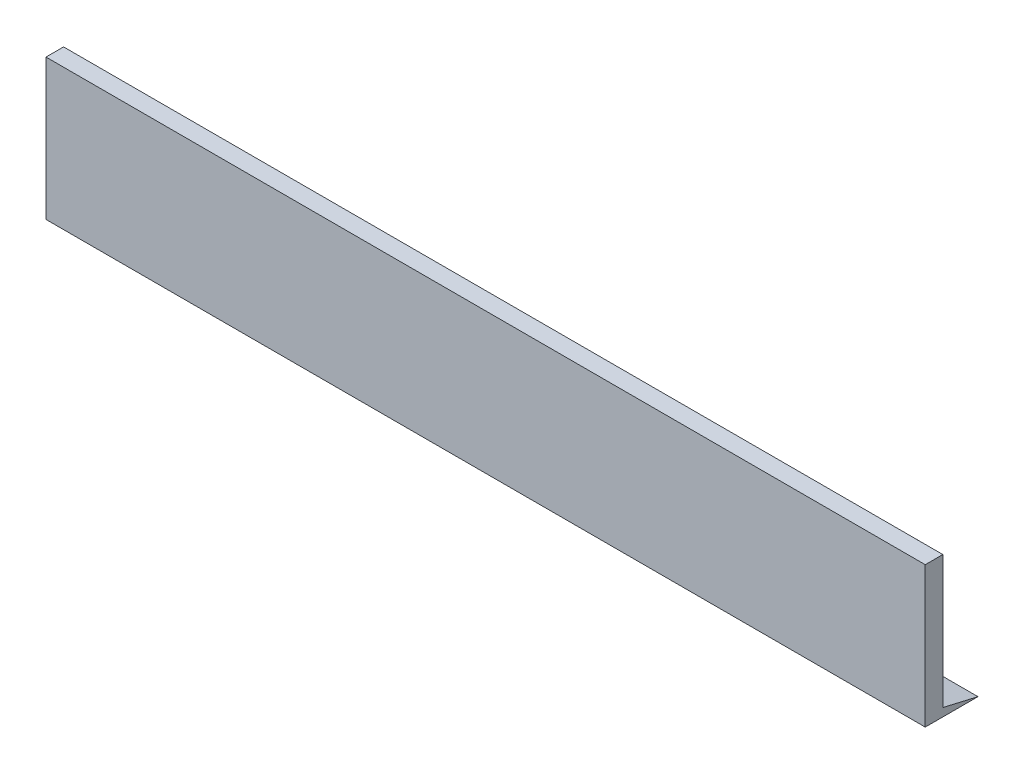
ISO-10303-21;
HEADER;
FILE_DESCRIPTION(('STEP AP214'),'2;1');
FILE_NAME('part.step','',(''),(''),'','','');
FILE_SCHEMA(('AUTOMOTIVE_DESIGN { 1 0 10303 214 1 1 1 1 }'));
ENDSEC;
DATA;
#1=APPLICATION_CONTEXT('core data for automotive mechanical design processes');
#2=APPLICATION_PROTOCOL_DEFINITION('international standard','automotive_design',2000,#1);
#3=PRODUCT_CONTEXT('',#1,'mechanical');
#4=PRODUCT('Part','Part','',(#3));
#5=PRODUCT_RELATED_PRODUCT_CATEGORY('part','',(#4));
#6=PRODUCT_DEFINITION_FORMATION('','',#4);
#7=PRODUCT_DEFINITION_CONTEXT('part definition',#1,'design');
#8=PRODUCT_DEFINITION('design','',#6,#7);
#9=PRODUCT_DEFINITION_SHAPE('','',#8);
#10=(LENGTH_UNIT() NAMED_UNIT(*) SI_UNIT(.MILLI.,.METRE.));
#11=(NAMED_UNIT(*) PLANE_ANGLE_UNIT() SI_UNIT($,.RADIAN.));
#12=(NAMED_UNIT(*) SI_UNIT($,.STERADIAN.) SOLID_ANGLE_UNIT());
#13=UNCERTAINTY_MEASURE_WITH_UNIT(LENGTH_MEASURE(1.E-05),#10,'distance_accuracy_value','');
#14=(GEOMETRIC_REPRESENTATION_CONTEXT(3) GLOBAL_UNCERTAINTY_ASSIGNED_CONTEXT((#13)) GLOBAL_UNIT_ASSIGNED_CONTEXT((#10,
#11,#12)) REPRESENTATION_CONTEXT('',''));
#15=CARTESIAN_POINT('',(0.,0.,0.));
#16=DIRECTION('',(0.,0.,1.));
#17=DIRECTION('',(1.,0.,0.));
#18=AXIS2_PLACEMENT_3D('',#15,#16,#17);
#19=CARTESIAN_POINT('',(0.,0.,0.));
#20=DIRECTION('',(0.,0.,-1.));
#21=DIRECTION('',(-1.,0.,0.));
#22=AXIS2_PLACEMENT_3D('',#19,#20,#21);
#23=PLANE('',#22);
#24=DIRECTION('',(0.,1.,0.));
#25=VECTOR('',#24,1.);
#26=CARTESIAN_POINT('',(250.,0.,0.));
#27=LINE('',#26,#25);
#28=CARTESIAN_POINT('',(250.,2.32063256608664,0.));
#29=VERTEX_POINT('',#28);
#30=CARTESIAN_POINT('',(250.,40.,0.));
#31=VERTEX_POINT('',#30);
#32=EDGE_CURVE('E107',#29,#31,#27,.T.);
#33=ORIENTED_EDGE('',*,*,#32,.F.);
#34=DIRECTION('',(-1.,0.,0.));
#35=VECTOR('',#34,1.);
#36=CARTESIAN_POINT('',(260.265735994403,2.32063256608664,0.));
#37=LINE('',#36,#35);
#38=CARTESIAN_POINT('',(0.,2.32063256608664,0.));
#39=VERTEX_POINT('',#38);
#40=EDGE_CURVE('E98',#29,#39,#37,.T.);
#41=ORIENTED_EDGE('',*,*,#40,.T.);
#42=DIRECTION('',(0.,-1.,0.));
#43=VECTOR('',#42,1.);
#44=CARTESIAN_POINT('',(0.,0.,0.));
#45=LINE('',#44,#43);
#46=CARTESIAN_POINT('',(0.,40.,0.));
#47=VERTEX_POINT('',#46);
#48=EDGE_CURVE('E102',#47,#39,#45,.T.);
#49=ORIENTED_EDGE('',*,*,#48,.F.);
#50=DIRECTION('',(-1.,0.,0.));
#51=VECTOR('',#50,1.);
#52=CARTESIAN_POINT('',(0.,40.,0.));
#53=LINE('',#52,#51);
#54=EDGE_CURVE('E74',#31,#47,#53,.T.);
#55=ORIENTED_EDGE('',*,*,#54,.F.);
#56=EDGE_LOOP('',(#33,#41,#49,#55));
#57=FACE_BOUND('',#56,.T.);
#58=ADVANCED_FACE('F33',(#57),#23,.T.);
#59=CARTESIAN_POINT('',(0.,0.,5.));
#60=DIRECTION('',(1.,0.,0.));
#61=DIRECTION('',(0.,0.,-1.));
#62=AXIS2_PLACEMENT_3D('',#59,#60,#61);
#63=PLANE('',#62);
#64=ORIENTED_EDGE('',*,*,#48,.T.);
#65=DIRECTION('',(0.,-0.226056131518663,-0.974114277383725));
#66=VECTOR('',#65,1.);
#67=CARTESIAN_POINT('',(0.,0.,-10.));
#68=LINE('',#67,#66);
#69=CARTESIAN_POINT('',(0.,0.,-10.));
#70=VERTEX_POINT('',#69);
#71=EDGE_CURVE('E50',#39,#70,#68,.T.);
#72=ORIENTED_EDGE('',*,*,#71,.T.);
#73=DIRECTION('',(0.,0.,-1.));
#74=VECTOR('',#73,1.);
#75=CARTESIAN_POINT('',(0.,0.,5.));
#76=LINE('',#75,#74);
#77=CARTESIAN_POINT('',(0.,0.,5.));
#78=VERTEX_POINT('',#77);
#79=EDGE_CURVE('E11',#78,#70,#76,.T.);
#80=ORIENTED_EDGE('',*,*,#79,.F.);
#81=DIRECTION('',(0.,-1.,0.));
#82=VECTOR('',#81,1.);
#83=CARTESIAN_POINT('',(0.,0.,5.));
#84=LINE('',#83,#82);
#85=CARTESIAN_POINT('',(0.,40.,5.));
#86=VERTEX_POINT('',#85);
#87=EDGE_CURVE('E114',#86,#78,#84,.T.);
#88=ORIENTED_EDGE('',*,*,#87,.F.);
#89=DIRECTION('',(0.,0.,-1.));
#90=VECTOR('',#89,1.);
#91=CARTESIAN_POINT('',(0.,40.,5.));
#92=LINE('',#91,#90);
#93=EDGE_CURVE('E120',#86,#47,#92,.T.);
#94=ORIENTED_EDGE('',*,*,#93,.T.);
#95=EDGE_LOOP('',(#64,#72,#80,#88,#94));
#96=FACE_BOUND('',#95,.T.);
#97=ADVANCED_FACE('F35',(#96),#63,.F.);
#98=CARTESIAN_POINT('',(0.,0.,5.));
#99=DIRECTION('',(0.,1.,0.));
#100=DIRECTION('',(0.,0.,1.));
#101=AXIS2_PLACEMENT_3D('',#98,#99,#100);
#102=PLANE('',#101);
#103=ORIENTED_EDGE('',*,*,#79,.T.);
#104=DIRECTION('',(-1.,0.,0.));
#105=VECTOR('',#104,1.);
#106=CARTESIAN_POINT('',(260.265735994403,0.,-10.));
#107=LINE('',#106,#105);
#108=CARTESIAN_POINT('',(250.,0.,-10.));
#109=VERTEX_POINT('',#108);
#110=EDGE_CURVE('E92',#109,#70,#107,.T.);
#111=ORIENTED_EDGE('',*,*,#110,.F.);
#112=DIRECTION('',(0.,0.,-1.));
#113=VECTOR('',#112,1.);
#114=CARTESIAN_POINT('',(250.,0.,5.));
#115=LINE('',#114,#113);
#116=CARTESIAN_POINT('',(250.,0.,5.));
#117=VERTEX_POINT('',#116);
#118=EDGE_CURVE('E42',#117,#109,#115,.T.);
#119=ORIENTED_EDGE('',*,*,#118,.F.);
#120=DIRECTION('',(1.,0.,0.));
#121=VECTOR('',#120,1.);
#122=CARTESIAN_POINT('',(0.,0.,5.));
#123=LINE('',#122,#121);
#124=EDGE_CURVE('E81',#78,#117,#123,.T.);
#125=ORIENTED_EDGE('',*,*,#124,.F.);
#126=EDGE_LOOP('',(#103,#111,#119,#125));
#127=FACE_BOUND('',#126,.T.);
#128=ADVANCED_FACE('F91',(#127),#102,.F.);
#129=CARTESIAN_POINT('',(250.,0.,5.));
#130=DIRECTION('',(-1.,0.,0.));
#131=DIRECTION('',(0.,0.,1.));
#132=AXIS2_PLACEMENT_3D('',#129,#130,#131);
#133=PLANE('',#132);
#134=ORIENTED_EDGE('',*,*,#118,.T.);
#135=DIRECTION('',(0.,0.226056131518663,0.974114277383725));
#136=VECTOR('',#135,1.);
#137=CARTESIAN_POINT('',(250.,0.,-10.));
#138=LINE('',#137,#136);
#139=EDGE_CURVE('E97',#109,#29,#138,.T.);
#140=ORIENTED_EDGE('',*,*,#139,.T.);
#141=ORIENTED_EDGE('',*,*,#32,.T.);
#142=DIRECTION('',(0.,0.,-1.));
#143=VECTOR('',#142,1.);
#144=CARTESIAN_POINT('',(250.,40.,5.));
#145=LINE('',#144,#143);
#146=CARTESIAN_POINT('',(250.,40.,5.));
#147=VERTEX_POINT('',#146);
#148=EDGE_CURVE('E126',#147,#31,#145,.T.);
#149=ORIENTED_EDGE('',*,*,#148,.F.);
#150=DIRECTION('',(0.,1.,0.));
#151=VECTOR('',#150,1.);
#152=CARTESIAN_POINT('',(250.,0.,5.));
#153=LINE('',#152,#151);
#154=EDGE_CURVE('E117',#117,#147,#153,.T.);
#155=ORIENTED_EDGE('',*,*,#154,.F.);
#156=EDGE_LOOP('',(#134,#140,#141,#149,#155));
#157=FACE_BOUND('',#156,.T.);
#158=ADVANCED_FACE('F131',(#157),#133,.F.);
#159=CARTESIAN_POINT('',(0.,40.,5.));
#160=DIRECTION('',(0.,-1.,0.));
#161=DIRECTION('',(0.,0.,-1.));
#162=AXIS2_PLACEMENT_3D('',#159,#160,#161);
#163=PLANE('',#162);
#164=ORIENTED_EDGE('',*,*,#54,.T.);
#165=ORIENTED_EDGE('',*,*,#93,.F.);
#166=DIRECTION('',(-1.,0.,0.));
#167=VECTOR('',#166,1.);
#168=CARTESIAN_POINT('',(0.,40.,5.));
#169=LINE('',#168,#167);
#170=EDGE_CURVE('E59',#147,#86,#169,.T.);
#171=ORIENTED_EDGE('',*,*,#170,.F.);
#172=ORIENTED_EDGE('',*,*,#148,.T.);
#173=EDGE_LOOP('',(#164,#165,#171,#172));
#174=FACE_BOUND('',#173,.T.);
#175=ADVANCED_FACE('F134',(#174),#163,.F.);
#176=CARTESIAN_POINT('',(0.,0.,5.));
#177=DIRECTION('',(0.,0.,-1.));
#178=DIRECTION('',(-1.,0.,0.));
#179=AXIS2_PLACEMENT_3D('',#176,#177,#178);
#180=PLANE('',#179);
#181=ORIENTED_EDGE('',*,*,#87,.T.);
#182=ORIENTED_EDGE('',*,*,#124,.T.);
#183=ORIENTED_EDGE('',*,*,#154,.T.);
#184=ORIENTED_EDGE('',*,*,#170,.T.);
#185=EDGE_LOOP('',(#181,#182,#183,#184));
#186=FACE_BOUND('',#185,.T.);
#187=ADVANCED_FACE('F142',(#186),#180,.F.);
#188=CARTESIAN_POINT('',(260.265735994403,0.,-10.));
#189=DIRECTION('',(0.,0.974114277383725,-0.226056131518663));
#190=DIRECTION('',(0.,0.226056131518663,0.974114277383725));
#191=AXIS2_PLACEMENT_3D('',#188,#189,#190);
#192=PLANE('',#191);
#193=ORIENTED_EDGE('',*,*,#139,.F.);
#194=ORIENTED_EDGE('',*,*,#110,.T.);
#195=ORIENTED_EDGE('',*,*,#71,.F.);
#196=ORIENTED_EDGE('',*,*,#40,.F.);
#197=EDGE_LOOP('',(#193,#194,#195,#196));
#198=FACE_BOUND('',#197,.T.);
#199=ADVANCED_FACE('F96',(#198),#192,.T.);
#200=CLOSED_SHELL('',(#58,#97,#128,#158,#175,#187,#199));
#201=MANIFOLD_SOLID_BREP('B2',#200);
#202=ADVANCED_BREP_SHAPE_REPRESENTATION('',(#18,#201),#14);
#203=SHAPE_DEFINITION_REPRESENTATION(#9,#202);
ENDSEC;
END-ISO-10303-21;
